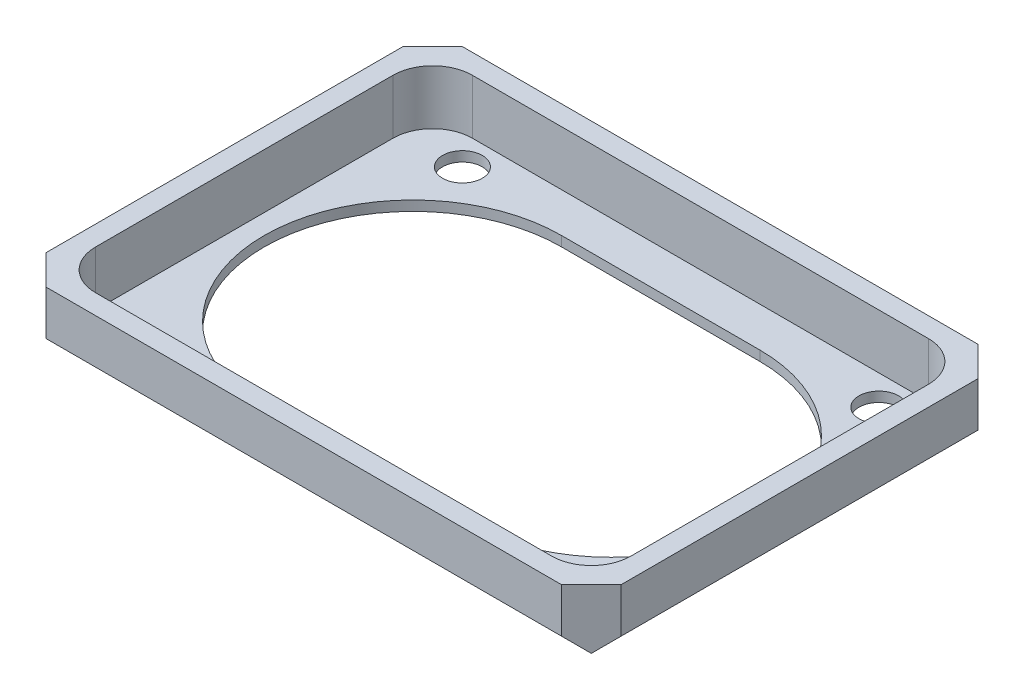
ISO-10303-21;
HEADER;
FILE_DESCRIPTION(('STEP AP214'),'2;1');
FILE_NAME('part.step','',(''),(''),'','','');
FILE_SCHEMA(('AUTOMOTIVE_DESIGN { 1 0 10303 214 1 1 1 1 }'));
ENDSEC;
DATA;
#1=APPLICATION_CONTEXT('core data for automotive mechanical design processes');
#2=APPLICATION_PROTOCOL_DEFINITION('international standard','automotive_design',2000,#1);
#3=PRODUCT_CONTEXT('',#1,'mechanical');
#4=PRODUCT('Part','Part','',(#3));
#5=PRODUCT_RELATED_PRODUCT_CATEGORY('part','',(#4));
#6=PRODUCT_DEFINITION_FORMATION('','',#4);
#7=PRODUCT_DEFINITION_CONTEXT('part definition',#1,'design');
#8=PRODUCT_DEFINITION('design','',#6,#7);
#9=PRODUCT_DEFINITION_SHAPE('','',#8);
#10=(LENGTH_UNIT() NAMED_UNIT(*) SI_UNIT(.MILLI.,.METRE.));
#11=(NAMED_UNIT(*) PLANE_ANGLE_UNIT() SI_UNIT($,.RADIAN.));
#12=(NAMED_UNIT(*) SI_UNIT($,.STERADIAN.) SOLID_ANGLE_UNIT());
#13=UNCERTAINTY_MEASURE_WITH_UNIT(LENGTH_MEASURE(1.E-05),#10,'distance_accuracy_value','');
#14=(GEOMETRIC_REPRESENTATION_CONTEXT(3) GLOBAL_UNCERTAINTY_ASSIGNED_CONTEXT((#13)) GLOBAL_UNIT_ASSIGNED_CONTEXT((#10,
#11,#12)) REPRESENTATION_CONTEXT('',''));
#15=CARTESIAN_POINT('',(0.,0.,0.));
#16=DIRECTION('',(0.,0.,1.));
#17=DIRECTION('',(1.,0.,0.));
#18=AXIS2_PLACEMENT_3D('',#15,#16,#17);
#19=CARTESIAN_POINT('',(0.,6.5,0.));
#20=DIRECTION('',(0.,1.,0.));
#21=DIRECTION('',(0.,0.,1.));
#22=AXIS2_PLACEMENT_3D('',#19,#20,#21);
#23=PLANE('',#22);
#24=CARTESIAN_POINT('',(-23.,6.5,15.));
#25=DIRECTION('',(0.,-1.,0.));
#26=DIRECTION('',(0.,0.,-1.));
#27=AXIS2_PLACEMENT_3D('',#24,#25,#26);
#28=CIRCLE('',#27,4.);
#29=CARTESIAN_POINT('',(-23.,6.5,19.));
#30=VERTEX_POINT('',#29);
#31=CARTESIAN_POINT('',(-27.,6.5,15.));
#32=VERTEX_POINT('',#31);
#33=EDGE_CURVE('E19',#30,#32,#28,.T.);
#34=ORIENTED_EDGE('',*,*,#33,.T.);
#35=DIRECTION('',(0.,0.,1.));
#36=VECTOR('',#35,1.);
#37=CARTESIAN_POINT('',(-27.,6.5,-19.));
#38=LINE('',#37,#36);
#39=CARTESIAN_POINT('',(-27.,6.5,-15.));
#40=VERTEX_POINT('',#39);
#41=EDGE_CURVE('E116',#32,#40,#38,.F.);
#42=ORIENTED_EDGE('',*,*,#41,.T.);
#43=CARTESIAN_POINT('',(-23.,6.5,-15.));
#44=DIRECTION('',(0.,-1.,0.));
#45=DIRECTION('',(0.,0.,-1.));
#46=AXIS2_PLACEMENT_3D('',#43,#44,#45);
#47=CIRCLE('',#46,4.);
#48=CARTESIAN_POINT('',(-23.,6.5,-19.));
#49=VERTEX_POINT('',#48);
#50=EDGE_CURVE('E196',#40,#49,#47,.T.);
#51=ORIENTED_EDGE('',*,*,#50,.T.);
#52=DIRECTION('',(-1.,0.,0.));
#53=VECTOR('',#52,1.);
#54=CARTESIAN_POINT('',(27.,6.5,-19.));
#55=LINE('',#54,#53);
#56=CARTESIAN_POINT('',(23.,6.5,-19.));
#57=VERTEX_POINT('',#56);
#58=EDGE_CURVE('E204',#49,#57,#55,.F.);
#59=ORIENTED_EDGE('',*,*,#58,.T.);
#60=CARTESIAN_POINT('',(23.,6.5,-15.));
#61=DIRECTION('',(0.,-1.,0.));
#62=DIRECTION('',(0.,0.,-1.));
#63=AXIS2_PLACEMENT_3D('',#60,#61,#62);
#64=CIRCLE('',#63,4.);
#65=CARTESIAN_POINT('',(27.,6.5,-15.));
#66=VERTEX_POINT('',#65);
#67=EDGE_CURVE('E199',#57,#66,#64,.T.);
#68=ORIENTED_EDGE('',*,*,#67,.T.);
#69=DIRECTION('',(0.,0.,-1.));
#70=VECTOR('',#69,1.);
#71=CARTESIAN_POINT('',(27.,6.5,19.));
#72=LINE('',#71,#70);
#73=CARTESIAN_POINT('',(27.,6.5,15.));
#74=VERTEX_POINT('',#73);
#75=EDGE_CURVE('E143',#66,#74,#72,.F.);
#76=ORIENTED_EDGE('',*,*,#75,.T.);
#77=CARTESIAN_POINT('',(23.,6.5,15.));
#78=DIRECTION('',(0.,-1.,0.));
#79=DIRECTION('',(0.,0.,-1.));
#80=AXIS2_PLACEMENT_3D('',#77,#78,#79);
#81=CIRCLE('',#80,4.);
#82=CARTESIAN_POINT('',(23.,6.5,19.));
#83=VERTEX_POINT('',#82);
#84=EDGE_CURVE('E135',#74,#83,#81,.T.);
#85=ORIENTED_EDGE('',*,*,#84,.T.);
#86=DIRECTION('',(1.,0.,0.));
#87=VECTOR('',#86,1.);
#88=CARTESIAN_POINT('',(-27.,6.5,19.));
#89=LINE('',#88,#87);
#90=EDGE_CURVE('E133',#83,#30,#89,.F.);
#91=ORIENTED_EDGE('',*,*,#90,.T.);
#92=EDGE_LOOP('',(#34,#42,#51,#59,#68,#76,#85,#91));
#93=FACE_BOUND('',#92,.T.);
#94=DIRECTION('',(-1.,0.,0.));
#95=VECTOR('',#94,1.);
#96=CARTESIAN_POINT('',(29.,6.5,-21.));
#97=LINE('',#96,#95);
#98=CARTESIAN_POINT('',(-26.,6.5,-21.));
#99=VERTEX_POINT('',#98);
#100=CARTESIAN_POINT('',(26.,6.5,-21.));
#101=VERTEX_POINT('',#100);
#102=EDGE_CURVE('E229',#99,#101,#97,.F.);
#103=ORIENTED_EDGE('',*,*,#102,.F.);
#104=DIRECTION('',(-0.707106781186548,0.,0.707106781186548));
#105=VECTOR('',#104,1.);
#106=CARTESIAN_POINT('',(-27.5,6.5,-19.5));
#107=LINE('',#106,#105);
#108=CARTESIAN_POINT('',(-29.,6.5,-18.));
#109=VERTEX_POINT('',#108);
#110=EDGE_CURVE('E247',#109,#99,#107,.F.);
#111=ORIENTED_EDGE('',*,*,#110,.F.);
#112=DIRECTION('',(0.,0.,1.));
#113=VECTOR('',#112,1.);
#114=CARTESIAN_POINT('',(-29.,6.5,-21.));
#115=LINE('',#114,#113);
#116=CARTESIAN_POINT('',(-29.,6.5,18.));
#117=VERTEX_POINT('',#116);
#118=EDGE_CURVE('E241',#117,#109,#115,.F.);
#119=ORIENTED_EDGE('',*,*,#118,.F.);
#120=DIRECTION('',(0.707106781186548,0.,0.707106781186548));
#121=VECTOR('',#120,1.);
#122=CARTESIAN_POINT('',(-27.5,6.5,19.5));
#123=LINE('',#122,#121);
#124=CARTESIAN_POINT('',(-26.,6.5,21.));
#125=VERTEX_POINT('',#124);
#126=EDGE_CURVE('E259',#125,#117,#123,.F.);
#127=ORIENTED_EDGE('',*,*,#126,.F.);
#128=DIRECTION('',(1.,0.,0.));
#129=VECTOR('',#128,1.);
#130=CARTESIAN_POINT('',(-29.,6.5,21.));
#131=LINE('',#130,#129);
#132=CARTESIAN_POINT('',(26.,6.5,21.));
#133=VERTEX_POINT('',#132);
#134=EDGE_CURVE('E253',#133,#125,#131,.F.);
#135=ORIENTED_EDGE('',*,*,#134,.F.);
#136=DIRECTION('',(0.707106781186548,0.,-0.707106781186548));
#137=VECTOR('',#136,1.);
#138=CARTESIAN_POINT('',(27.5,6.5,19.5));
#139=LINE('',#138,#137);
#140=CARTESIAN_POINT('',(29.,6.5,18.));
#141=VERTEX_POINT('',#140);
#142=EDGE_CURVE('E268',#141,#133,#139,.F.);
#143=ORIENTED_EDGE('',*,*,#142,.F.);
#144=DIRECTION('',(0.,0.,-1.));
#145=VECTOR('',#144,1.);
#146=CARTESIAN_POINT('',(29.,6.5,21.));
#147=LINE('',#146,#145);
#148=CARTESIAN_POINT('',(29.,6.5,-18.));
#149=VERTEX_POINT('',#148);
#150=EDGE_CURVE('E226',#149,#141,#147,.F.);
#151=ORIENTED_EDGE('',*,*,#150,.F.);
#152=DIRECTION('',(-0.707106781186548,0.,-0.707106781186548));
#153=VECTOR('',#152,1.);
#154=CARTESIAN_POINT('',(27.5,6.5,-19.5));
#155=LINE('',#154,#153);
#156=EDGE_CURVE('E235',#101,#149,#155,.F.);
#157=ORIENTED_EDGE('',*,*,#156,.F.);
#158=EDGE_LOOP('',(#103,#111,#119,#127,#135,#143,#151,#157));
#159=FACE_BOUND('',#158,.T.);
#160=ADVANCED_FACE('F16',(#93,#159),#23,.T.);
#161=CARTESIAN_POINT('',(-27.,6.5,-19.));
#162=DIRECTION('',(-1.,0.,0.));
#163=DIRECTION('',(0.,0.,1.));
#164=AXIS2_PLACEMENT_3D('',#161,#162,#163);
#165=PLANE('',#164);
#166=DIRECTION('',(0.,-1.,0.));
#167=VECTOR('',#166,1.);
#168=CARTESIAN_POINT('',(-27.,14.9734,15.));
#169=LINE('',#168,#167);
#170=CARTESIAN_POINT('',(-27.,0.999999999999999,15.));
#171=VERTEX_POINT('',#170);
#172=EDGE_CURVE('E119',#32,#171,#169,.T.);
#173=ORIENTED_EDGE('',*,*,#172,.T.);
#174=DIRECTION('',(0.,0.,1.));
#175=VECTOR('',#174,1.);
#176=CARTESIAN_POINT('',(-27.,1.,0.));
#177=LINE('',#176,#175);
#178=CARTESIAN_POINT('',(-27.,0.999999999999999,-15.));
#179=VERTEX_POINT('',#178);
#180=EDGE_CURVE('E195',#179,#171,#177,.T.);
#181=ORIENTED_EDGE('',*,*,#180,.F.);
#182=DIRECTION('',(0.,-1.,0.));
#183=VECTOR('',#182,1.);
#184=CARTESIAN_POINT('',(-27.,14.9734,-15.));
#185=LINE('',#184,#183);
#186=EDGE_CURVE('E121',#179,#40,#185,.F.);
#187=ORIENTED_EDGE('',*,*,#186,.T.);
#188=ORIENTED_EDGE('',*,*,#41,.F.);
#189=EDGE_LOOP('',(#173,#181,#187,#188));
#190=FACE_BOUND('',#189,.T.);
#191=ADVANCED_FACE('F117',(#190),#165,.F.);
#192=CARTESIAN_POINT('',(-23.,14.9734,15.));
#193=DIRECTION('',(0.,-1.,0.));
#194=DIRECTION('',(0.,0.,-1.));
#195=AXIS2_PLACEMENT_3D('',#192,#193,#194);
#196=CYLINDRICAL_SURFACE('',#195,4.);
#197=ORIENTED_EDGE('',*,*,#33,.F.);
#198=DIRECTION('',(0.,1.,0.));
#199=VECTOR('',#198,1.);
#200=CARTESIAN_POINT('',(-23.,6.5,19.));
#201=LINE('',#200,#199);
#202=CARTESIAN_POINT('',(-23.,1.,19.));
#203=VERTEX_POINT('',#202);
#204=EDGE_CURVE('E128',#30,#203,#201,.F.);
#205=ORIENTED_EDGE('',*,*,#204,.T.);
#206=CARTESIAN_POINT('',(-23.,0.999999999999999,15.));
#207=DIRECTION('',(0.,-1.,0.));
#208=DIRECTION('',(0.,0.,-1.));
#209=AXIS2_PLACEMENT_3D('',#206,#207,#208);
#210=CIRCLE('',#209,4.);
#211=EDGE_CURVE('E127',#171,#203,#210,.F.);
#212=ORIENTED_EDGE('',*,*,#211,.F.);
#213=ORIENTED_EDGE('',*,*,#172,.F.);
#214=EDGE_LOOP('',(#197,#205,#212,#213));
#215=FACE_BOUND('',#214,.T.);
#216=ADVANCED_FACE('F126',(#215),#196,.F.);
#217=CARTESIAN_POINT('',(-27.,6.5,19.));
#218=DIRECTION('',(0.,0.,1.));
#219=DIRECTION('',(1.,0.,0.));
#220=AXIS2_PLACEMENT_3D('',#217,#218,#219);
#221=PLANE('',#220);
#222=DIRECTION('',(0.,-1.,0.));
#223=VECTOR('',#222,1.);
#224=CARTESIAN_POINT('',(23.,14.9734,19.));
#225=LINE('',#224,#223);
#226=CARTESIAN_POINT('',(23.,0.999999999999999,19.));
#227=VERTEX_POINT('',#226);
#228=EDGE_CURVE('E140',#83,#227,#225,.T.);
#229=ORIENTED_EDGE('',*,*,#228,.T.);
#230=DIRECTION('',(1.,0.,0.));
#231=VECTOR('',#230,1.);
#232=CARTESIAN_POINT('',(0.,1.,19.));
#233=LINE('',#232,#231);
#234=EDGE_CURVE('E193',#203,#227,#233,.T.);
#235=ORIENTED_EDGE('',*,*,#234,.F.);
#236=ORIENTED_EDGE('',*,*,#204,.F.);
#237=ORIENTED_EDGE('',*,*,#90,.F.);
#238=EDGE_LOOP('',(#229,#235,#236,#237));
#239=FACE_BOUND('',#238,.T.);
#240=ADVANCED_FACE('F548',(#239),#221,.F.);
#241=CARTESIAN_POINT('',(23.,14.9734,15.));
#242=DIRECTION('',(0.,-1.,0.));
#243=DIRECTION('',(0.,0.,-1.));
#244=AXIS2_PLACEMENT_3D('',#241,#242,#243);
#245=CYLINDRICAL_SURFACE('',#244,4.);
#246=ORIENTED_EDGE('',*,*,#84,.F.);
#247=DIRECTION('',(0.,1.,0.));
#248=VECTOR('',#247,1.);
#249=CARTESIAN_POINT('',(27.,6.5,15.));
#250=LINE('',#249,#248);
#251=CARTESIAN_POINT('',(27.,1.,15.));
#252=VERTEX_POINT('',#251);
#253=EDGE_CURVE('E206',#74,#252,#250,.F.);
#254=ORIENTED_EDGE('',*,*,#253,.T.);
#255=CARTESIAN_POINT('',(23.,0.999999999999999,15.));
#256=DIRECTION('',(0.,-1.,0.));
#257=DIRECTION('',(0.,0.,-1.));
#258=AXIS2_PLACEMENT_3D('',#255,#256,#257);
#259=CIRCLE('',#258,4.);
#260=EDGE_CURVE('E191',#227,#252,#259,.F.);
#261=ORIENTED_EDGE('',*,*,#260,.F.);
#262=ORIENTED_EDGE('',*,*,#228,.F.);
#263=EDGE_LOOP('',(#246,#254,#261,#262));
#264=FACE_BOUND('',#263,.T.);
#265=ADVANCED_FACE('F553',(#264),#245,.F.);
#266=CARTESIAN_POINT('',(27.,6.5,19.));
#267=DIRECTION('',(1.,0.,0.));
#268=DIRECTION('',(0.,0.,-1.));
#269=AXIS2_PLACEMENT_3D('',#266,#267,#268);
#270=PLANE('',#269);
#271=DIRECTION('',(0.,-1.,0.));
#272=VECTOR('',#271,1.);
#273=CARTESIAN_POINT('',(27.,14.9734,-15.));
#274=LINE('',#273,#272);
#275=CARTESIAN_POINT('',(27.,0.999999999999999,-15.));
#276=VERTEX_POINT('',#275);
#277=EDGE_CURVE('E201',#66,#276,#274,.T.);
#278=ORIENTED_EDGE('',*,*,#277,.T.);
#279=DIRECTION('',(0.,0.,1.));
#280=VECTOR('',#279,1.);
#281=CARTESIAN_POINT('',(27.,1.,0.));
#282=LINE('',#281,#280);
#283=EDGE_CURVE('E190',#252,#276,#282,.F.);
#284=ORIENTED_EDGE('',*,*,#283,.F.);
#285=ORIENTED_EDGE('',*,*,#253,.F.);
#286=ORIENTED_EDGE('',*,*,#75,.F.);
#287=EDGE_LOOP('',(#278,#284,#285,#286));
#288=FACE_BOUND('',#287,.T.);
#289=ADVANCED_FACE('F556',(#288),#270,.F.);
#290=CARTESIAN_POINT('',(23.,14.9734,-15.));
#291=DIRECTION('',(0.,-1.,0.));
#292=DIRECTION('',(0.,0.,-1.));
#293=AXIS2_PLACEMENT_3D('',#290,#291,#292);
#294=CYLINDRICAL_SURFACE('',#293,4.);
#295=ORIENTED_EDGE('',*,*,#67,.F.);
#296=DIRECTION('',(0.,1.,0.));
#297=VECTOR('',#296,1.);
#298=CARTESIAN_POINT('',(23.,6.5,-19.));
#299=LINE('',#298,#297);
#300=CARTESIAN_POINT('',(23.,1.,-19.));
#301=VERTEX_POINT('',#300);
#302=EDGE_CURVE('E216',#57,#301,#299,.F.);
#303=ORIENTED_EDGE('',*,*,#302,.T.);
#304=CARTESIAN_POINT('',(23.,0.999999999999999,-15.));
#305=DIRECTION('',(0.,-1.,0.));
#306=DIRECTION('',(0.,0.,-1.));
#307=AXIS2_PLACEMENT_3D('',#304,#305,#306);
#308=CIRCLE('',#307,4.);
#309=EDGE_CURVE('E188',#276,#301,#308,.F.);
#310=ORIENTED_EDGE('',*,*,#309,.F.);
#311=ORIENTED_EDGE('',*,*,#277,.F.);
#312=EDGE_LOOP('',(#295,#303,#310,#311));
#313=FACE_BOUND('',#312,.T.);
#314=ADVANCED_FACE('F388',(#313),#294,.F.);
#315=CARTESIAN_POINT('',(27.,6.5,-19.));
#316=DIRECTION('',(0.,0.,-1.));
#317=DIRECTION('',(-1.,0.,0.));
#318=AXIS2_PLACEMENT_3D('',#315,#316,#317);
#319=PLANE('',#318);
#320=ORIENTED_EDGE('',*,*,#302,.F.);
#321=ORIENTED_EDGE('',*,*,#58,.F.);
#322=DIRECTION('',(0.,-1.,0.));
#323=VECTOR('',#322,1.);
#324=CARTESIAN_POINT('',(-23.,14.9734,-19.));
#325=LINE('',#324,#323);
#326=CARTESIAN_POINT('',(-23.,0.999999999999999,-19.));
#327=VERTEX_POINT('',#326);
#328=EDGE_CURVE('E198',#49,#327,#325,.T.);
#329=ORIENTED_EDGE('',*,*,#328,.T.);
#330=DIRECTION('',(1.,0.,0.));
#331=VECTOR('',#330,1.);
#332=CARTESIAN_POINT('',(0.,1.,-19.));
#333=LINE('',#332,#331);
#334=EDGE_CURVE('E187',#301,#327,#333,.F.);
#335=ORIENTED_EDGE('',*,*,#334,.F.);
#336=EDGE_LOOP('',(#320,#321,#329,#335));
#337=FACE_BOUND('',#336,.T.);
#338=ADVANCED_FACE('F374',(#337),#319,.F.);
#339=CARTESIAN_POINT('',(-23.,14.9734,-15.));
#340=DIRECTION('',(0.,-1.,0.));
#341=DIRECTION('',(0.,0.,-1.));
#342=AXIS2_PLACEMENT_3D('',#339,#340,#341);
#343=CYLINDRICAL_SURFACE('',#342,4.);
#344=ORIENTED_EDGE('',*,*,#50,.F.);
#345=ORIENTED_EDGE('',*,*,#186,.F.);
#346=CARTESIAN_POINT('',(-23.,0.999999999999999,-15.));
#347=DIRECTION('',(0.,-1.,0.));
#348=DIRECTION('',(0.,0.,-1.));
#349=AXIS2_PLACEMENT_3D('',#346,#347,#348);
#350=CIRCLE('',#349,4.);
#351=EDGE_CURVE('E183',#327,#179,#350,.F.);
#352=ORIENTED_EDGE('',*,*,#351,.F.);
#353=ORIENTED_EDGE('',*,*,#328,.F.);
#354=EDGE_LOOP('',(#344,#345,#352,#353));
#355=FACE_BOUND('',#354,.T.);
#356=ADVANCED_FACE('F376',(#355),#343,.F.);
#357=CARTESIAN_POINT('',(29.,0.,21.));
#358=DIRECTION('',(1.,0.,0.));
#359=DIRECTION('',(0.,0.,-1.));
#360=AXIS2_PLACEMENT_3D('',#357,#358,#359);
#361=PLANE('',#360);
#362=DIRECTION('',(0.,1.,0.));
#363=VECTOR('',#362,1.);
#364=CARTESIAN_POINT('',(29.,3.25,18.));
#365=LINE('',#364,#363);
#366=CARTESIAN_POINT('',(29.,2.,18.));
#367=VERTEX_POINT('',#366);
#368=EDGE_CURVE('E265',#367,#141,#365,.T.);
#369=ORIENTED_EDGE('',*,*,#368,.F.);
#370=DIRECTION('',(0.,0.,1.));
#371=VECTOR('',#370,1.);
#372=CARTESIAN_POINT('',(29.,2.,0.));
#373=LINE('',#372,#371);
#374=CARTESIAN_POINT('',(29.,2.,-18.));
#375=VERTEX_POINT('',#374);
#376=EDGE_CURVE('E186',#375,#367,#373,.T.);
#377=ORIENTED_EDGE('',*,*,#376,.F.);
#378=DIRECTION('',(0.,1.,0.));
#379=VECTOR('',#378,1.);
#380=CARTESIAN_POINT('',(29.,3.25,-18.));
#381=LINE('',#380,#379);
#382=EDGE_CURVE('E238',#149,#375,#381,.F.);
#383=ORIENTED_EDGE('',*,*,#382,.F.);
#384=ORIENTED_EDGE('',*,*,#150,.T.);
#385=EDGE_LOOP('',(#369,#377,#383,#384));
#386=FACE_BOUND('',#385,.T.);
#387=ADVANCED_FACE('F378',(#386),#361,.T.);
#388=CARTESIAN_POINT('',(29.,0.,-21.));
#389=DIRECTION('',(0.,0.,-1.));
#390=DIRECTION('',(-1.,0.,0.));
#391=AXIS2_PLACEMENT_3D('',#388,#389,#390);
#392=PLANE('',#391);
#393=DIRECTION('',(0.,1.,0.));
#394=VECTOR('',#393,1.);
#395=CARTESIAN_POINT('',(26.,3.25,-21.));
#396=LINE('',#395,#394);
#397=CARTESIAN_POINT('',(26.,2.,-21.));
#398=VERTEX_POINT('',#397);
#399=EDGE_CURVE('E232',#398,#101,#396,.T.);
#400=ORIENTED_EDGE('',*,*,#399,.F.);
#401=DIRECTION('',(1.,0.,0.));
#402=VECTOR('',#401,1.);
#403=CARTESIAN_POINT('',(0.,2.,-21.));
#404=LINE('',#403,#402);
#405=CARTESIAN_POINT('',(-26.,2.,-21.));
#406=VERTEX_POINT('',#405);
#407=EDGE_CURVE('E297',#406,#398,#404,.T.);
#408=ORIENTED_EDGE('',*,*,#407,.F.);
#409=DIRECTION('',(0.,1.,0.));
#410=VECTOR('',#409,1.);
#411=CARTESIAN_POINT('',(-26.,3.25,-21.));
#412=LINE('',#411,#410);
#413=EDGE_CURVE('E250',#99,#406,#412,.F.);
#414=ORIENTED_EDGE('',*,*,#413,.F.);
#415=ORIENTED_EDGE('',*,*,#102,.T.);
#416=EDGE_LOOP('',(#400,#408,#414,#415));
#417=FACE_BOUND('',#416,.T.);
#418=ADVANCED_FACE('F385',(#417),#392,.T.);
#419=CARTESIAN_POINT('',(27.5,3.25,-19.5));
#420=DIRECTION('',(0.707106781186548,0.,-0.707106781186548));
#421=DIRECTION('',(-0.707106781186548,0.,-0.707106781186548));
#422=AXIS2_PLACEMENT_3D('',#419,#420,#421);
#423=PLANE('',#422);
#424=ORIENTED_EDGE('',*,*,#382,.T.);
#425=DIRECTION('',(0.577350269189626,0.577350269189626,0.577350269189625));
#426=VECTOR('',#425,1.);
#427=CARTESIAN_POINT('',(27.5,0.5,-19.5));
#428=LINE('',#427,#426);
#429=CARTESIAN_POINT('',(27.5,0.499999999999999,-19.5));
#430=VERTEX_POINT('',#429);
#431=EDGE_CURVE('E288',#430,#375,#428,.T.);
#432=ORIENTED_EDGE('',*,*,#431,.F.);
#433=DIRECTION('',(0.577350269189625,-0.577350269189626,0.577350269189626));
#434=VECTOR('',#433,1.);
#435=CARTESIAN_POINT('',(26.,2.,-21.));
#436=LINE('',#435,#434);
#437=EDGE_CURVE('E300',#398,#430,#436,.T.);
#438=ORIENTED_EDGE('',*,*,#437,.F.);
#439=ORIENTED_EDGE('',*,*,#399,.T.);
#440=ORIENTED_EDGE('',*,*,#156,.T.);
#441=EDGE_LOOP('',(#424,#432,#438,#439,#440));
#442=FACE_BOUND('',#441,.T.);
#443=ADVANCED_FACE('F455',(#442),#423,.T.);
#444=CARTESIAN_POINT('',(-29.,0.,-21.));
#445=DIRECTION('',(-1.,0.,0.));
#446=DIRECTION('',(0.,0.,1.));
#447=AXIS2_PLACEMENT_3D('',#444,#445,#446);
#448=PLANE('',#447);
#449=DIRECTION('',(0.,1.,0.));
#450=VECTOR('',#449,1.);
#451=CARTESIAN_POINT('',(-29.,3.25,-18.));
#452=LINE('',#451,#450);
#453=CARTESIAN_POINT('',(-29.,2.,-18.));
#454=VERTEX_POINT('',#453);
#455=EDGE_CURVE('E244',#454,#109,#452,.T.);
#456=ORIENTED_EDGE('',*,*,#455,.F.);
#457=DIRECTION('',(0.,0.,1.));
#458=VECTOR('',#457,1.);
#459=CARTESIAN_POINT('',(-29.,2.,0.));
#460=LINE('',#459,#458);
#461=CARTESIAN_POINT('',(-29.,2.,18.));
#462=VERTEX_POINT('',#461);
#463=EDGE_CURVE('E309',#462,#454,#460,.F.);
#464=ORIENTED_EDGE('',*,*,#463,.F.);
#465=DIRECTION('',(0.,1.,0.));
#466=VECTOR('',#465,1.);
#467=CARTESIAN_POINT('',(-29.,3.25,18.));
#468=LINE('',#467,#466);
#469=EDGE_CURVE('E262',#117,#462,#468,.F.);
#470=ORIENTED_EDGE('',*,*,#469,.F.);
#471=ORIENTED_EDGE('',*,*,#118,.T.);
#472=EDGE_LOOP('',(#456,#464,#470,#471));
#473=FACE_BOUND('',#472,.T.);
#474=ADVANCED_FACE('F451',(#473),#448,.T.);
#475=CARTESIAN_POINT('',(-27.5,3.25,-19.5));
#476=DIRECTION('',(-0.707106781186548,0.,-0.707106781186548));
#477=DIRECTION('',(-0.707106781186548,0.,0.707106781186548));
#478=AXIS2_PLACEMENT_3D('',#475,#476,#477);
#479=PLANE('',#478);
#480=DIRECTION('',(0.577350269189625,0.577350269189626,-0.577350269189626));
#481=VECTOR('',#480,1.);
#482=CARTESIAN_POINT('',(-27.5,0.5,-19.5));
#483=LINE('',#482,#481);
#484=CARTESIAN_POINT('',(-27.5,0.5,-19.5));
#485=VERTEX_POINT('',#484);
#486=EDGE_CURVE('E294',#485,#406,#483,.T.);
#487=ORIENTED_EDGE('',*,*,#486,.F.);
#488=DIRECTION('',(0.577350269189626,-0.577350269189626,-0.577350269189625));
#489=VECTOR('',#488,1.);
#490=CARTESIAN_POINT('',(-29.,2.,-18.));
#491=LINE('',#490,#489);
#492=EDGE_CURVE('E312',#454,#485,#491,.T.);
#493=ORIENTED_EDGE('',*,*,#492,.F.);
#494=ORIENTED_EDGE('',*,*,#455,.T.);
#495=ORIENTED_EDGE('',*,*,#110,.T.);
#496=ORIENTED_EDGE('',*,*,#413,.T.);
#497=EDGE_LOOP('',(#487,#493,#494,#495,#496));
#498=FACE_BOUND('',#497,.T.);
#499=ADVANCED_FACE('F447',(#498),#479,.T.);
#500=CARTESIAN_POINT('',(-29.,0.,21.));
#501=DIRECTION('',(0.,0.,1.));
#502=DIRECTION('',(1.,0.,0.));
#503=AXIS2_PLACEMENT_3D('',#500,#501,#502);
#504=PLANE('',#503);
#505=DIRECTION('',(0.,1.,0.));
#506=VECTOR('',#505,1.);
#507=CARTESIAN_POINT('',(-26.,3.25,21.));
#508=LINE('',#507,#506);
#509=CARTESIAN_POINT('',(-26.,2.,21.));
#510=VERTEX_POINT('',#509);
#511=EDGE_CURVE('E256',#510,#125,#508,.T.);
#512=ORIENTED_EDGE('',*,*,#511,.F.);
#513=DIRECTION('',(1.,0.,0.));
#514=VECTOR('',#513,1.);
#515=CARTESIAN_POINT('',(0.,2.,21.));
#516=LINE('',#515,#514);
#517=CARTESIAN_POINT('',(26.,2.,21.));
#518=VERTEX_POINT('',#517);
#519=EDGE_CURVE('E315',#518,#510,#516,.F.);
#520=ORIENTED_EDGE('',*,*,#519,.F.);
#521=DIRECTION('',(0.,1.,0.));
#522=VECTOR('',#521,1.);
#523=CARTESIAN_POINT('',(26.,3.25,21.));
#524=LINE('',#523,#522);
#525=EDGE_CURVE('E271',#133,#518,#524,.F.);
#526=ORIENTED_EDGE('',*,*,#525,.F.);
#527=ORIENTED_EDGE('',*,*,#134,.T.);
#528=EDGE_LOOP('',(#512,#520,#526,#527));
#529=FACE_BOUND('',#528,.T.);
#530=ADVANCED_FACE('F443',(#529),#504,.T.);
#531=CARTESIAN_POINT('',(-27.5,3.25,19.5));
#532=DIRECTION('',(-0.707106781186548,0.,0.707106781186548));
#533=DIRECTION('',(0.707106781186548,0.,0.707106781186548));
#534=AXIS2_PLACEMENT_3D('',#531,#532,#533);
#535=PLANE('',#534);
#536=DIRECTION('',(-0.577350269189626,0.577350269189626,-0.577350269189625));
#537=VECTOR('',#536,1.);
#538=CARTESIAN_POINT('',(-27.5,0.5,19.5));
#539=LINE('',#538,#537);
#540=CARTESIAN_POINT('',(-27.5,0.499999999999999,19.5));
#541=VERTEX_POINT('',#540);
#542=EDGE_CURVE('E306',#541,#462,#539,.T.);
#543=ORIENTED_EDGE('',*,*,#542,.F.);
#544=DIRECTION('',(-0.577350269189625,-0.577350269189626,-0.577350269189626));
#545=VECTOR('',#544,1.);
#546=CARTESIAN_POINT('',(-26.,2.,21.));
#547=LINE('',#546,#545);
#548=EDGE_CURVE('E318',#510,#541,#547,.T.);
#549=ORIENTED_EDGE('',*,*,#548,.F.);
#550=ORIENTED_EDGE('',*,*,#511,.T.);
#551=ORIENTED_EDGE('',*,*,#126,.T.);
#552=ORIENTED_EDGE('',*,*,#469,.T.);
#553=EDGE_LOOP('',(#543,#549,#550,#551,#552));
#554=FACE_BOUND('',#553,.T.);
#555=ADVANCED_FACE('F439',(#554),#535,.T.);
#556=CARTESIAN_POINT('',(27.5,3.25,19.5));
#557=DIRECTION('',(0.707106781186548,0.,0.707106781186548));
#558=DIRECTION('',(0.707106781186548,0.,-0.707106781186548));
#559=AXIS2_PLACEMENT_3D('',#556,#557,#558);
#560=PLANE('',#559);
#561=DIRECTION('',(-0.577350269189625,0.577350269189626,0.577350269189626));
#562=VECTOR('',#561,1.);
#563=CARTESIAN_POINT('',(27.5,0.5,19.5));
#564=LINE('',#563,#562);
#565=CARTESIAN_POINT('',(27.5,0.499999999999999,19.5));
#566=VERTEX_POINT('',#565);
#567=EDGE_CURVE('E182',#566,#518,#564,.T.);
#568=ORIENTED_EDGE('',*,*,#567,.F.);
#569=DIRECTION('',(-0.577350269189626,-0.577350269189626,0.577350269189625));
#570=VECTOR('',#569,1.);
#571=CARTESIAN_POINT('',(29.,2.,18.));
#572=LINE('',#571,#570);
#573=EDGE_CURVE('E285',#367,#566,#572,.T.);
#574=ORIENTED_EDGE('',*,*,#573,.F.);
#575=ORIENTED_EDGE('',*,*,#368,.T.);
#576=ORIENTED_EDGE('',*,*,#142,.T.);
#577=ORIENTED_EDGE('',*,*,#525,.T.);
#578=EDGE_LOOP('',(#568,#574,#575,#576,#577));
#579=FACE_BOUND('',#578,.T.);
#580=ADVANCED_FACE('F368',(#579),#560,.T.);
#581=CARTESIAN_POINT('',(0.,1.,0.));
#582=DIRECTION('',(0.,1.,0.));
#583=DIRECTION('',(0.,0.,1.));
#584=AXIS2_PLACEMENT_3D('',#581,#582,#583);
#585=PLANE('',#584);
#586=CARTESIAN_POINT('',(-21.,1.,-16.));
#587=DIRECTION('',(0.,-1.,0.));
#588=DIRECTION('',(0.,0.,-1.));
#589=AXIS2_PLACEMENT_3D('',#586,#587,#588);
#590=CIRCLE('',#589,2.);
#591=CARTESIAN_POINT('',(-21.,1.,-18.));
#592=VERTEX_POINT('',#591);
#593=EDGE_CURVE('E162',#592,#592,#590,.T.);
#594=ORIENTED_EDGE('',*,*,#593,.T.);
#595=EDGE_LOOP('',(#594));
#596=FACE_BOUND('',#595,.T.);
#597=CARTESIAN_POINT('',(21.,1.,-16.));
#598=DIRECTION('',(0.,-1.,0.));
#599=DIRECTION('',(0.,0.,-1.));
#600=AXIS2_PLACEMENT_3D('',#597,#598,#599);
#601=CIRCLE('',#600,2.);
#602=CARTESIAN_POINT('',(21.,1.,-18.));
#603=VERTEX_POINT('',#602);
#604=EDGE_CURVE('E166',#603,#603,#601,.T.);
#605=ORIENTED_EDGE('',*,*,#604,.T.);
#606=EDGE_LOOP('',(#605));
#607=FACE_BOUND('',#606,.T.);
#608=CARTESIAN_POINT('',(21.,1.,16.));
#609=DIRECTION('',(0.,-1.,0.));
#610=DIRECTION('',(0.,0.,-1.));
#611=AXIS2_PLACEMENT_3D('',#608,#609,#610);
#612=CIRCLE('',#611,2.);
#613=CARTESIAN_POINT('',(21.,1.,14.));
#614=VERTEX_POINT('',#613);
#615=EDGE_CURVE('E169',#614,#614,#612,.T.);
#616=ORIENTED_EDGE('',*,*,#615,.T.);
#617=EDGE_LOOP('',(#616));
#618=FACE_BOUND('',#617,.T.);
#619=CARTESIAN_POINT('',(-21.,1.,16.));
#620=DIRECTION('',(0.,-1.,0.));
#621=DIRECTION('',(0.,0.,-1.));
#622=AXIS2_PLACEMENT_3D('',#619,#620,#621);
#623=CIRCLE('',#622,2.);
#624=CARTESIAN_POINT('',(-21.,1.,14.));
#625=VERTEX_POINT('',#624);
#626=EDGE_CURVE('E172',#625,#625,#623,.T.);
#627=ORIENTED_EDGE('',*,*,#626,.T.);
#628=EDGE_LOOP('',(#627));
#629=FACE_BOUND('',#628,.T.);
#630=DIRECTION('',(1.,0.,0.));
#631=VECTOR('',#630,1.);
#632=CARTESIAN_POINT('',(10.,1.,15.));
#633=LINE('',#632,#631);
#634=CARTESIAN_POINT('',(10.,1.,15.));
#635=VERTEX_POINT('',#634);
#636=CARTESIAN_POINT('',(-10.,1.,15.));
#637=VERTEX_POINT('',#636);
#638=EDGE_CURVE('E276',#635,#637,#633,.F.);
#639=ORIENTED_EDGE('',*,*,#638,.T.);
#640=CARTESIAN_POINT('',(-10.,1.,0.));
#641=DIRECTION('',(0.,-1.,0.));
#642=DIRECTION('',(0.,0.,-1.));
#643=AXIS2_PLACEMENT_3D('',#640,#641,#642);
#644=CIRCLE('',#643,15.);
#645=CARTESIAN_POINT('',(-10.,1.,-15.));
#646=VERTEX_POINT('',#645);
#647=EDGE_CURVE('E179',#637,#646,#644,.T.);
#648=ORIENTED_EDGE('',*,*,#647,.T.);
#649=DIRECTION('',(-1.,0.,0.));
#650=VECTOR('',#649,1.);
#651=CARTESIAN_POINT('',(-10.,1.,-15.));
#652=LINE('',#651,#650);
#653=CARTESIAN_POINT('',(10.,1.,-15.));
#654=VERTEX_POINT('',#653);
#655=EDGE_CURVE('E274',#646,#654,#652,.F.);
#656=ORIENTED_EDGE('',*,*,#655,.T.);
#657=CARTESIAN_POINT('',(10.,1.,0.));
#658=DIRECTION('',(0.,-1.,0.));
#659=DIRECTION('',(0.,0.,-1.));
#660=AXIS2_PLACEMENT_3D('',#657,#658,#659);
#661=CIRCLE('',#660,15.);
#662=EDGE_CURVE('E176',#654,#635,#661,.T.);
#663=ORIENTED_EDGE('',*,*,#662,.T.);
#664=EDGE_LOOP('',(#639,#648,#656,#663));
#665=FACE_BOUND('',#664,.T.);
#666=ORIENTED_EDGE('',*,*,#334,.T.);
#667=ORIENTED_EDGE('',*,*,#351,.T.);
#668=ORIENTED_EDGE('',*,*,#180,.T.);
#669=ORIENTED_EDGE('',*,*,#211,.T.);
#670=ORIENTED_EDGE('',*,*,#234,.T.);
#671=ORIENTED_EDGE('',*,*,#260,.T.);
#672=ORIENTED_EDGE('',*,*,#283,.T.);
#673=ORIENTED_EDGE('',*,*,#309,.T.);
#674=EDGE_LOOP('',(#666,#667,#668,#669,#670,#671,#672,#673));
#675=FACE_BOUND('',#674,.T.);
#676=ADVANCED_FACE('F364',(#596,#607,#618,#629,#665,#675),#585,.T.);
#677=CARTESIAN_POINT('',(28.,1.,0.));
#678=DIRECTION('',(0.707106781186548,-0.707106781186548,0.));
#679=DIRECTION('',(0.707106781186548,0.707106781186548,0.));
#680=AXIS2_PLACEMENT_3D('',#677,#678,#679);
#681=PLANE('',#680);
#682=DIRECTION('',(-0.577350269189626,-0.577350269189626,0.577350269189626));
#683=VECTOR('',#682,1.);
#684=CARTESIAN_POINT('',(27.5,0.5,-19.5));
#685=LINE('',#684,#683);
#686=CARTESIAN_POINT('',(27.,0.,-19.));
#687=VERTEX_POINT('',#686);
#688=EDGE_CURVE('E291',#430,#687,#685,.T.);
#689=ORIENTED_EDGE('',*,*,#688,.F.);
#690=ORIENTED_EDGE('',*,*,#431,.T.);
#691=ORIENTED_EDGE('',*,*,#376,.T.);
#692=ORIENTED_EDGE('',*,*,#573,.T.);
#693=DIRECTION('',(0.577350269189626,0.577350269189626,0.577350269189626));
#694=VECTOR('',#693,1.);
#695=CARTESIAN_POINT('',(27.,0.,19.));
#696=LINE('',#695,#694);
#697=CARTESIAN_POINT('',(27.,0.,19.));
#698=VERTEX_POINT('',#697);
#699=EDGE_CURVE('E324',#698,#566,#696,.T.);
#700=ORIENTED_EDGE('',*,*,#699,.F.);
#701=DIRECTION('',(0.,0.,1.));
#702=VECTOR('',#701,1.);
#703=CARTESIAN_POINT('',(27.,0.,0.));
#704=LINE('',#703,#702);
#705=EDGE_CURVE('E165',#698,#687,#704,.F.);
#706=ORIENTED_EDGE('',*,*,#705,.T.);
#707=EDGE_LOOP('',(#689,#690,#691,#692,#700,#706));
#708=FACE_BOUND('',#707,.T.);
#709=ADVANCED_FACE('F367',(#708),#681,.T.);
#710=CARTESIAN_POINT('',(0.,1.,-20.));
#711=DIRECTION('',(0.,-0.707106781186548,-0.707106781186548));
#712=DIRECTION('',(0.,0.707106781186548,-0.707106781186548));
#713=AXIS2_PLACEMENT_3D('',#710,#711,#712);
#714=PLANE('',#713);
#715=ORIENTED_EDGE('',*,*,#407,.T.);
#716=ORIENTED_EDGE('',*,*,#437,.T.);
#717=ORIENTED_EDGE('',*,*,#688,.T.);
#718=DIRECTION('',(1.,0.,0.));
#719=VECTOR('',#718,1.);
#720=CARTESIAN_POINT('',(0.,0.,-19.));
#721=LINE('',#720,#719);
#722=CARTESIAN_POINT('',(-27.,0.,-19.));
#723=VERTEX_POINT('',#722);
#724=EDGE_CURVE('E338',#687,#723,#721,.F.);
#725=ORIENTED_EDGE('',*,*,#724,.T.);
#726=DIRECTION('',(0.577350269189626,-0.577350269189626,0.577350269189626));
#727=VECTOR('',#726,1.);
#728=CARTESIAN_POINT('',(-27.5,0.5,-19.5));
#729=LINE('',#728,#727);
#730=EDGE_CURVE('E303',#485,#723,#729,.T.);
#731=ORIENTED_EDGE('',*,*,#730,.F.);
#732=ORIENTED_EDGE('',*,*,#486,.T.);
#733=EDGE_LOOP('',(#715,#716,#717,#725,#731,#732));
#734=FACE_BOUND('',#733,.T.);
#735=ADVANCED_FACE('F429',(#734),#714,.T.);
#736=CARTESIAN_POINT('',(-28.,1.,0.));
#737=DIRECTION('',(-0.707106781186548,-0.707106781186548,0.));
#738=DIRECTION('',(0.707106781186548,-0.707106781186548,0.));
#739=AXIS2_PLACEMENT_3D('',#736,#737,#738);
#740=PLANE('',#739);
#741=ORIENTED_EDGE('',*,*,#463,.T.);
#742=ORIENTED_EDGE('',*,*,#492,.T.);
#743=ORIENTED_EDGE('',*,*,#730,.T.);
#744=DIRECTION('',(0.,0.,1.));
#745=VECTOR('',#744,1.);
#746=CARTESIAN_POINT('',(-27.,0.,0.));
#747=LINE('',#746,#745);
#748=CARTESIAN_POINT('',(-27.,0.,19.));
#749=VERTEX_POINT('',#748);
#750=EDGE_CURVE('E341',#723,#749,#747,.T.);
#751=ORIENTED_EDGE('',*,*,#750,.T.);
#752=DIRECTION('',(0.577350269189626,-0.577350269189626,-0.577350269189626));
#753=VECTOR('',#752,1.);
#754=CARTESIAN_POINT('',(-27.5,0.5,19.5));
#755=LINE('',#754,#753);
#756=EDGE_CURVE('E321',#541,#749,#755,.T.);
#757=ORIENTED_EDGE('',*,*,#756,.F.);
#758=ORIENTED_EDGE('',*,*,#542,.T.);
#759=EDGE_LOOP('',(#741,#742,#743,#751,#757,#758));
#760=FACE_BOUND('',#759,.T.);
#761=ADVANCED_FACE('F425',(#760),#740,.T.);
#762=CARTESIAN_POINT('',(0.,1.,20.));
#763=DIRECTION('',(0.,-0.707106781186548,0.707106781186548));
#764=DIRECTION('',(0.,-0.707106781186548,-0.707106781186548));
#765=AXIS2_PLACEMENT_3D('',#762,#763,#764);
#766=PLANE('',#765);
#767=ORIENTED_EDGE('',*,*,#699,.T.);
#768=ORIENTED_EDGE('',*,*,#567,.T.);
#769=ORIENTED_EDGE('',*,*,#519,.T.);
#770=ORIENTED_EDGE('',*,*,#548,.T.);
#771=ORIENTED_EDGE('',*,*,#756,.T.);
#772=DIRECTION('',(1.,0.,0.));
#773=VECTOR('',#772,1.);
#774=CARTESIAN_POINT('',(0.,0.,19.));
#775=LINE('',#774,#773);
#776=EDGE_CURVE('E161',#749,#698,#775,.T.);
#777=ORIENTED_EDGE('',*,*,#776,.T.);
#778=EDGE_LOOP('',(#767,#768,#769,#770,#771,#777));
#779=FACE_BOUND('',#778,.T.);
#780=ADVANCED_FACE('F422',(#779),#766,.T.);
#781=CARTESIAN_POINT('',(-10.,0.,0.));
#782=DIRECTION('',(0.,-1.,0.));
#783=DIRECTION('',(0.,0.,-1.));
#784=AXIS2_PLACEMENT_3D('',#781,#782,#783);
#785=CYLINDRICAL_SURFACE('',#784,15.);
#786=ORIENTED_EDGE('',*,*,#647,.F.);
#787=DIRECTION('',(0.,1.,0.));
#788=VECTOR('',#787,1.);
#789=CARTESIAN_POINT('',(-10.,0.,15.));
#790=LINE('',#789,#788);
#791=CARTESIAN_POINT('',(-10.,0.,15.));
#792=VERTEX_POINT('',#791);
#793=EDGE_CURVE('E175',#637,#792,#790,.F.);
#794=ORIENTED_EDGE('',*,*,#793,.T.);
#795=CARTESIAN_POINT('',(-10.,0.,0.));
#796=DIRECTION('',(0.,-1.,0.));
#797=DIRECTION('',(0.,0.,-1.));
#798=AXIS2_PLACEMENT_3D('',#795,#796,#797);
#799=CIRCLE('',#798,15.);
#800=CARTESIAN_POINT('',(-10.,0.,-15.));
#801=VERTEX_POINT('',#800);
#802=EDGE_CURVE('E158',#792,#801,#799,.T.);
#803=ORIENTED_EDGE('',*,*,#802,.T.);
#804=DIRECTION('',(0.,1.,0.));
#805=VECTOR('',#804,1.);
#806=CARTESIAN_POINT('',(-10.,0.,-15.));
#807=LINE('',#806,#805);
#808=EDGE_CURVE('E181',#801,#646,#807,.T.);
#809=ORIENTED_EDGE('',*,*,#808,.T.);
#810=EDGE_LOOP('',(#786,#794,#803,#809));
#811=FACE_BOUND('',#810,.T.);
#812=ADVANCED_FACE('F362',(#811),#785,.F.);
#813=CARTESIAN_POINT('',(-10.,0.,-15.));
#814=DIRECTION('',(0.,0.,-1.));
#815=DIRECTION('',(-1.,0.,0.));
#816=AXIS2_PLACEMENT_3D('',#813,#814,#815);
#817=PLANE('',#816);
#818=ORIENTED_EDGE('',*,*,#655,.F.);
#819=ORIENTED_EDGE('',*,*,#808,.F.);
#820=DIRECTION('',(1.,0.,0.));
#821=VECTOR('',#820,1.);
#822=CARTESIAN_POINT('',(0.,0.,-15.));
#823=LINE('',#822,#821);
#824=CARTESIAN_POINT('',(10.,0.,-15.));
#825=VERTEX_POINT('',#824);
#826=EDGE_CURVE('E157',#801,#825,#823,.T.);
#827=ORIENTED_EDGE('',*,*,#826,.T.);
#828=DIRECTION('',(0.,-1.,0.));
#829=VECTOR('',#828,1.);
#830=CARTESIAN_POINT('',(10.,0.,-15.));
#831=LINE('',#830,#829);
#832=EDGE_CURVE('E178',#825,#654,#831,.F.);
#833=ORIENTED_EDGE('',*,*,#832,.T.);
#834=EDGE_LOOP('',(#818,#819,#827,#833));
#835=FACE_BOUND('',#834,.T.);
#836=ADVANCED_FACE('F360',(#835),#817,.F.);
#837=CARTESIAN_POINT('',(10.,0.,0.));
#838=DIRECTION('',(0.,-1.,0.));
#839=DIRECTION('',(0.,0.,-1.));
#840=AXIS2_PLACEMENT_3D('',#837,#838,#839);
#841=CYLINDRICAL_SURFACE('',#840,15.);
#842=ORIENTED_EDGE('',*,*,#662,.F.);
#843=ORIENTED_EDGE('',*,*,#832,.F.);
#844=CARTESIAN_POINT('',(10.,0.,0.));
#845=DIRECTION('',(0.,-1.,0.));
#846=DIRECTION('',(0.,0.,-1.));
#847=AXIS2_PLACEMENT_3D('',#844,#845,#846);
#848=CIRCLE('',#847,15.);
#849=CARTESIAN_POINT('',(10.,0.,15.));
#850=VERTEX_POINT('',#849);
#851=EDGE_CURVE('E154',#825,#850,#848,.T.);
#852=ORIENTED_EDGE('',*,*,#851,.T.);
#853=DIRECTION('',(0.,1.,0.));
#854=VECTOR('',#853,1.);
#855=CARTESIAN_POINT('',(10.,0.,15.));
#856=LINE('',#855,#854);
#857=EDGE_CURVE('E34',#850,#635,#856,.T.);
#858=ORIENTED_EDGE('',*,*,#857,.T.);
#859=EDGE_LOOP('',(#842,#843,#852,#858));
#860=FACE_BOUND('',#859,.T.);
#861=ADVANCED_FACE('F357',(#860),#841,.F.);
#862=CARTESIAN_POINT('',(10.,0.,15.));
#863=DIRECTION('',(0.,0.,1.));
#864=DIRECTION('',(1.,0.,0.));
#865=AXIS2_PLACEMENT_3D('',#862,#863,#864);
#866=PLANE('',#865);
#867=ORIENTED_EDGE('',*,*,#638,.F.);
#868=ORIENTED_EDGE('',*,*,#857,.F.);
#869=DIRECTION('',(1.,0.,0.));
#870=VECTOR('',#869,1.);
#871=CARTESIAN_POINT('',(0.,0.,15.));
#872=LINE('',#871,#870);
#873=EDGE_CURVE('E153',#850,#792,#872,.F.);
#874=ORIENTED_EDGE('',*,*,#873,.T.);
#875=ORIENTED_EDGE('',*,*,#793,.F.);
#876=EDGE_LOOP('',(#867,#868,#874,#875));
#877=FACE_BOUND('',#876,.T.);
#878=ADVANCED_FACE('F349',(#877),#866,.F.);
#879=CARTESIAN_POINT('',(-21.,0.,16.));
#880=DIRECTION('',(0.,-1.,0.));
#881=DIRECTION('',(0.,0.,-1.));
#882=AXIS2_PLACEMENT_3D('',#879,#880,#881);
#883=CYLINDRICAL_SURFACE('',#882,2.);
#884=ORIENTED_EDGE('',*,*,#626,.F.);
#885=EDGE_LOOP('',(#884));
#886=FACE_BOUND('',#885,.T.);
#887=CARTESIAN_POINT('',(-21.,0.,16.));
#888=DIRECTION('',(0.,-1.,0.));
#889=DIRECTION('',(0.,0.,-1.));
#890=AXIS2_PLACEMENT_3D('',#887,#888,#889);
#891=CIRCLE('',#890,2.);
#892=CARTESIAN_POINT('',(-21.,0.,14.));
#893=VERTEX_POINT('',#892);
#894=EDGE_CURVE('E150',#893,#893,#891,.T.);
#895=ORIENTED_EDGE('',*,*,#894,.T.);
#896=EDGE_LOOP('',(#895));
#897=FACE_BOUND('',#896,.T.);
#898=ADVANCED_FACE('F409',(#886,#897),#883,.F.);
#899=CARTESIAN_POINT('',(21.,0.,16.));
#900=DIRECTION('',(0.,-1.,0.));
#901=DIRECTION('',(0.,0.,-1.));
#902=AXIS2_PLACEMENT_3D('',#899,#900,#901);
#903=CYLINDRICAL_SURFACE('',#902,2.);
#904=ORIENTED_EDGE('',*,*,#615,.F.);
#905=EDGE_LOOP('',(#904));
#906=FACE_BOUND('',#905,.T.);
#907=CARTESIAN_POINT('',(21.,0.,16.));
#908=DIRECTION('',(0.,-1.,0.));
#909=DIRECTION('',(0.,0.,-1.));
#910=AXIS2_PLACEMENT_3D('',#907,#908,#909);
#911=CIRCLE('',#910,2.);
#912=CARTESIAN_POINT('',(21.,0.,14.));
#913=VERTEX_POINT('',#912);
#914=EDGE_CURVE('E147',#913,#913,#911,.T.);
#915=ORIENTED_EDGE('',*,*,#914,.T.);
#916=EDGE_LOOP('',(#915));
#917=FACE_BOUND('',#916,.T.);
#918=ADVANCED_FACE('F405',(#906,#917),#903,.F.);
#919=CARTESIAN_POINT('',(21.,0.,-16.));
#920=DIRECTION('',(0.,-1.,0.));
#921=DIRECTION('',(0.,0.,-1.));
#922=AXIS2_PLACEMENT_3D('',#919,#920,#921);
#923=CYLINDRICAL_SURFACE('',#922,2.);
#924=ORIENTED_EDGE('',*,*,#604,.F.);
#925=EDGE_LOOP('',(#924));
#926=FACE_BOUND('',#925,.T.);
#927=CARTESIAN_POINT('',(21.,0.,-16.));
#928=DIRECTION('',(0.,-1.,0.));
#929=DIRECTION('',(0.,0.,-1.));
#930=AXIS2_PLACEMENT_3D('',#927,#928,#929);
#931=CIRCLE('',#930,2.);
#932=CARTESIAN_POINT('',(21.,0.,-18.));
#933=VERTEX_POINT('',#932);
#934=EDGE_CURVE('E25',#933,#933,#931,.T.);
#935=ORIENTED_EDGE('',*,*,#934,.T.);
#936=EDGE_LOOP('',(#935));
#937=FACE_BOUND('',#936,.T.);
#938=ADVANCED_FACE('F397',(#926,#937),#923,.F.);
#939=CARTESIAN_POINT('',(-21.,0.,-16.));
#940=DIRECTION('',(0.,-1.,0.));
#941=DIRECTION('',(0.,0.,-1.));
#942=AXIS2_PLACEMENT_3D('',#939,#940,#941);
#943=CYLINDRICAL_SURFACE('',#942,2.);
#944=ORIENTED_EDGE('',*,*,#593,.F.);
#945=EDGE_LOOP('',(#944));
#946=FACE_BOUND('',#945,.T.);
#947=CARTESIAN_POINT('',(-21.,0.,-16.));
#948=DIRECTION('',(0.,-1.,0.));
#949=DIRECTION('',(0.,0.,-1.));
#950=AXIS2_PLACEMENT_3D('',#947,#948,#949);
#951=CIRCLE('',#950,2.);
#952=CARTESIAN_POINT('',(-21.,0.,-18.));
#953=VERTEX_POINT('',#952);
#954=EDGE_CURVE('E11',#953,#953,#951,.T.);
#955=ORIENTED_EDGE('',*,*,#954,.T.);
#956=EDGE_LOOP('',(#955));
#957=FACE_BOUND('',#956,.T.);
#958=ADVANCED_FACE('F391',(#946,#957),#943,.F.);
#959=CARTESIAN_POINT('',(0.,0.,0.));
#960=DIRECTION('',(0.,1.,0.));
#961=DIRECTION('',(0.,0.,1.));
#962=AXIS2_PLACEMENT_3D('',#959,#960,#961);
#963=PLANE('',#962);
#964=ORIENTED_EDGE('',*,*,#954,.F.);
#965=EDGE_LOOP('',(#964));
#966=FACE_BOUND('',#965,.T.);
#967=ORIENTED_EDGE('',*,*,#934,.F.);
#968=EDGE_LOOP('',(#967));
#969=FACE_BOUND('',#968,.T.);
#970=ORIENTED_EDGE('',*,*,#914,.F.);
#971=EDGE_LOOP('',(#970));
#972=FACE_BOUND('',#971,.T.);
#973=ORIENTED_EDGE('',*,*,#894,.F.);
#974=EDGE_LOOP('',(#973));
#975=FACE_BOUND('',#974,.T.);
#976=ORIENTED_EDGE('',*,*,#851,.F.);
#977=ORIENTED_EDGE('',*,*,#826,.F.);
#978=ORIENTED_EDGE('',*,*,#802,.F.);
#979=ORIENTED_EDGE('',*,*,#873,.F.);
#980=EDGE_LOOP('',(#976,#977,#978,#979));
#981=FACE_BOUND('',#980,.T.);
#982=ORIENTED_EDGE('',*,*,#750,.F.);
#983=ORIENTED_EDGE('',*,*,#724,.F.);
#984=ORIENTED_EDGE('',*,*,#705,.F.);
#985=ORIENTED_EDGE('',*,*,#776,.F.);
#986=EDGE_LOOP('',(#982,#983,#984,#985));
#987=FACE_BOUND('',#986,.T.);
#988=ADVANCED_FACE('F352',(#966,#969,#972,#975,#981,#987),#963,.F.);
#989=CLOSED_SHELL('',(#160,#191,#216,#240,#265,#289,#314,#338,#356,#387,#418,#443,#474,#499,
#530,#555,#580,#676,#709,#735,#761,#780,#812,#836,#861,#878,#898,#918,#938,#958,#988));
#990=MANIFOLD_SOLID_BREP('B1',#989);
#991=ADVANCED_BREP_SHAPE_REPRESENTATION('',(#18,#990),#14);
#992=SHAPE_DEFINITION_REPRESENTATION(#9,#991);
ENDSEC;
END-ISO-10303-21;
